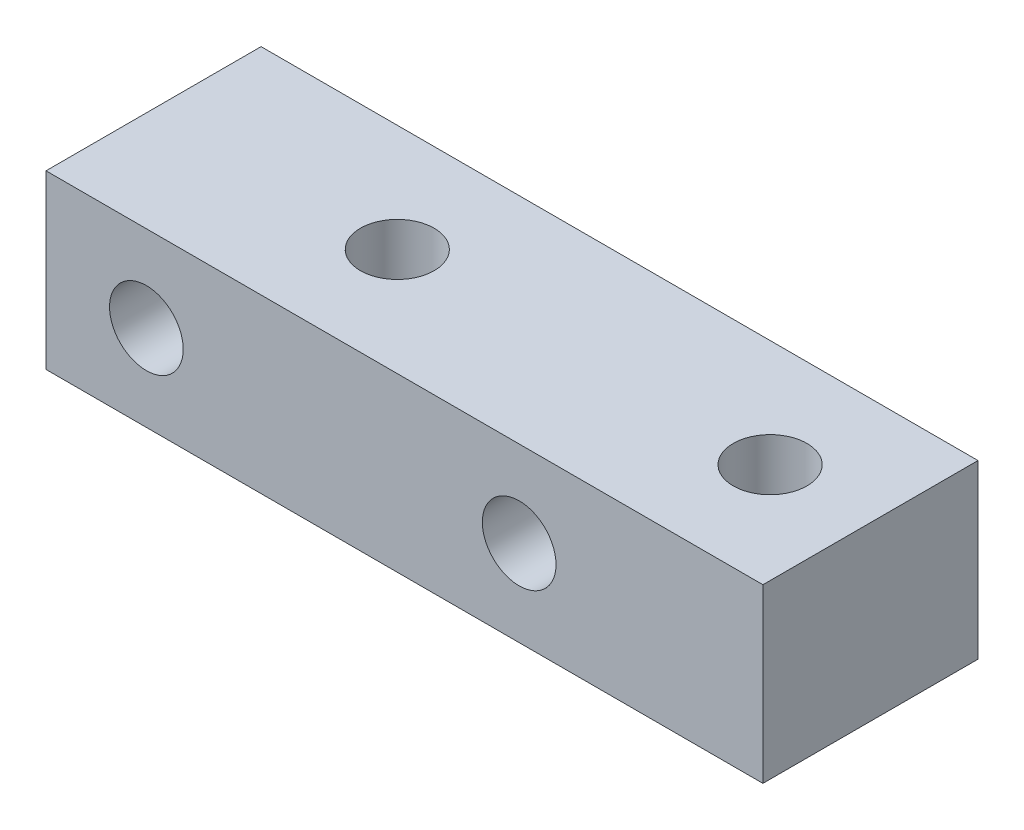
ISO-10303-21;
HEADER;
FILE_DESCRIPTION(('STEP AP214'),'2;1');
FILE_NAME('part.step','',(''),(''),'','','');
FILE_SCHEMA(('AUTOMOTIVE_DESIGN { 1 0 10303 214 1 1 1 1 }'));
ENDSEC;
DATA;
#1=APPLICATION_CONTEXT('core data for automotive mechanical design processes');
#2=APPLICATION_PROTOCOL_DEFINITION('international standard','automotive_design',2000,#1);
#3=PRODUCT_CONTEXT('',#1,'mechanical');
#4=PRODUCT('Part','Part','',(#3));
#5=PRODUCT_RELATED_PRODUCT_CATEGORY('part','',(#4));
#6=PRODUCT_DEFINITION_FORMATION('','',#4);
#7=PRODUCT_DEFINITION_CONTEXT('part definition',#1,'design');
#8=PRODUCT_DEFINITION('design','',#6,#7);
#9=PRODUCT_DEFINITION_SHAPE('','',#8);
#10=(LENGTH_UNIT() NAMED_UNIT(*) SI_UNIT(.MILLI.,.METRE.));
#11=(NAMED_UNIT(*) PLANE_ANGLE_UNIT() SI_UNIT($,.RADIAN.));
#12=(NAMED_UNIT(*) SI_UNIT($,.STERADIAN.) SOLID_ANGLE_UNIT());
#13=UNCERTAINTY_MEASURE_WITH_UNIT(LENGTH_MEASURE(1.E-05),#10,'distance_accuracy_value','');
#14=(GEOMETRIC_REPRESENTATION_CONTEXT(3) GLOBAL_UNCERTAINTY_ASSIGNED_CONTEXT((#13)) GLOBAL_UNIT_ASSIGNED_CONTEXT((#10,
#11,#12)) REPRESENTATION_CONTEXT('',''));
#15=CARTESIAN_POINT('',(0.,0.,0.));
#16=DIRECTION('',(0.,0.,1.));
#17=DIRECTION('',(1.,0.,0.));
#18=AXIS2_PLACEMENT_3D('',#15,#16,#17);
#19=CARTESIAN_POINT('',(31.75,-15.24,-9.525));
#20=DIRECTION('',(1.,0.,0.));
#21=DIRECTION('',(0.,0.,-1.));
#22=AXIS2_PLACEMENT_3D('',#19,#20,#21);
#23=PLANE('',#22);
#24=DIRECTION('',(0.,0.,-1.));
#25=VECTOR('',#24,1.);
#26=CARTESIAN_POINT('',(31.75,0.,-9.525));
#27=LINE('',#26,#25);
#28=CARTESIAN_POINT('',(31.75,0.,9.525));
#29=VERTEX_POINT('',#28);
#30=CARTESIAN_POINT('',(31.75,0.,-9.525));
#31=VERTEX_POINT('',#30);
#32=EDGE_CURVE('E103',#29,#31,#27,.T.);
#33=ORIENTED_EDGE('',*,*,#32,.F.);
#34=DIRECTION('',(0.,1.,0.));
#35=VECTOR('',#34,1.);
#36=CARTESIAN_POINT('',(31.75,-15.24,9.525));
#37=LINE('',#36,#35);
#38=CARTESIAN_POINT('',(31.75,-15.24,9.525));
#39=VERTEX_POINT('',#38);
#40=EDGE_CURVE('E11',#39,#29,#37,.T.);
#41=ORIENTED_EDGE('',*,*,#40,.F.);
#42=DIRECTION('',(0.,0.,-1.));
#43=VECTOR('',#42,1.);
#44=CARTESIAN_POINT('',(31.75,-15.24,-9.525));
#45=LINE('',#44,#43);
#46=CARTESIAN_POINT('',(31.75,-15.24,-9.525));
#47=VERTEX_POINT('',#46);
#48=EDGE_CURVE('E96',#39,#47,#45,.T.);
#49=ORIENTED_EDGE('',*,*,#48,.T.);
#50=DIRECTION('',(0.,1.,0.));
#51=VECTOR('',#50,1.);
#52=CARTESIAN_POINT('',(31.75,-15.24,-9.525));
#53=LINE('',#52,#51);
#54=EDGE_CURVE('E41',#47,#31,#53,.T.);
#55=ORIENTED_EDGE('',*,*,#54,.T.);
#56=EDGE_LOOP('',(#33,#41,#49,#55));
#57=FACE_BOUND('',#56,.T.);
#58=ADVANCED_FACE('F38',(#57),#23,.T.);
#59=CARTESIAN_POINT('',(-31.75,-15.24,9.525));
#60=DIRECTION('',(0.,0.,1.));
#61=DIRECTION('',(1.,0.,0.));
#62=AXIS2_PLACEMENT_3D('',#59,#60,#61);
#63=PLANE('',#62);
#64=CARTESIAN_POINT('',(-22.86,-7.62,9.525));
#65=DIRECTION('',(0.,0.,1.));
#66=DIRECTION('',(1.,0.,0.));
#67=AXIS2_PLACEMENT_3D('',#64,#65,#66);
#68=CIRCLE('',#67,3.26389999999999);
#69=CARTESIAN_POINT('',(-19.5961,-7.62,9.525));
#70=VERTEX_POINT('',#69);
#71=EDGE_CURVE('E147',#70,#70,#68,.T.);
#72=ORIENTED_EDGE('',*,*,#71,.F.);
#73=EDGE_LOOP('',(#72));
#74=FACE_BOUND('',#73,.T.);
#75=CARTESIAN_POINT('',(10.16,-7.62,9.525));
#76=DIRECTION('',(0.,0.,1.));
#77=DIRECTION('',(1.,0.,0.));
#78=AXIS2_PLACEMENT_3D('',#75,#76,#77);
#79=CIRCLE('',#78,3.26389999999999);
#80=CARTESIAN_POINT('',(13.4239,-7.62,9.525));
#81=VERTEX_POINT('',#80);
#82=EDGE_CURVE('E142',#81,#81,#79,.T.);
#83=ORIENTED_EDGE('',*,*,#82,.F.);
#84=EDGE_LOOP('',(#83));
#85=FACE_BOUND('',#84,.T.);
#86=DIRECTION('',(1.,0.,0.));
#87=VECTOR('',#86,1.);
#88=CARTESIAN_POINT('',(-31.75,0.,9.525));
#89=LINE('',#88,#87);
#90=CARTESIAN_POINT('',(-31.75,0.,9.525));
#91=VERTEX_POINT('',#90);
#92=EDGE_CURVE('E98',#91,#29,#89,.T.);
#93=ORIENTED_EDGE('',*,*,#92,.F.);
#94=DIRECTION('',(0.,1.,0.));
#95=VECTOR('',#94,1.);
#96=CARTESIAN_POINT('',(-31.75,-15.24,9.525));
#97=LINE('',#96,#95);
#98=CARTESIAN_POINT('',(-31.75,-15.24,9.525));
#99=VERTEX_POINT('',#98);
#100=EDGE_CURVE('E47',#99,#91,#97,.T.);
#101=ORIENTED_EDGE('',*,*,#100,.F.);
#102=DIRECTION('',(1.,0.,0.));
#103=VECTOR('',#102,1.);
#104=CARTESIAN_POINT('',(-31.75,-15.24,9.525));
#105=LINE('',#104,#103);
#106=EDGE_CURVE('E93',#99,#39,#105,.T.);
#107=ORIENTED_EDGE('',*,*,#106,.T.);
#108=ORIENTED_EDGE('',*,*,#40,.T.);
#109=EDGE_LOOP('',(#93,#101,#107,#108));
#110=FACE_BOUND('',#109,.T.);
#111=ADVANCED_FACE('F114',(#74,#85,#110),#63,.T.);
#112=CARTESIAN_POINT('',(-31.75,-15.24,-9.525));
#113=DIRECTION('',(-1.,0.,0.));
#114=DIRECTION('',(0.,0.,1.));
#115=AXIS2_PLACEMENT_3D('',#112,#113,#114);
#116=PLANE('',#115);
#117=DIRECTION('',(0.,0.,1.));
#118=VECTOR('',#117,1.);
#119=CARTESIAN_POINT('',(-31.75,0.,-9.525));
#120=LINE('',#119,#118);
#121=CARTESIAN_POINT('',(-31.75,0.,-9.525));
#122=VERTEX_POINT('',#121);
#123=EDGE_CURVE('E88',#122,#91,#120,.T.);
#124=ORIENTED_EDGE('',*,*,#123,.F.);
#125=DIRECTION('',(0.,1.,0.));
#126=VECTOR('',#125,1.);
#127=CARTESIAN_POINT('',(-31.75,-15.24,-9.525));
#128=LINE('',#127,#126);
#129=CARTESIAN_POINT('',(-31.75,-15.24,-9.525));
#130=VERTEX_POINT('',#129);
#131=EDGE_CURVE('E83',#130,#122,#128,.T.);
#132=ORIENTED_EDGE('',*,*,#131,.F.);
#133=DIRECTION('',(0.,0.,1.));
#134=VECTOR('',#133,1.);
#135=CARTESIAN_POINT('',(-31.75,-15.24,-9.525));
#136=LINE('',#135,#134);
#137=EDGE_CURVE('E86',#130,#99,#136,.T.);
#138=ORIENTED_EDGE('',*,*,#137,.T.);
#139=ORIENTED_EDGE('',*,*,#100,.T.);
#140=EDGE_LOOP('',(#124,#132,#138,#139));
#141=FACE_BOUND('',#140,.T.);
#142=ADVANCED_FACE('F85',(#141),#116,.T.);
#143=CARTESIAN_POINT('',(-31.75,-15.24,-9.525));
#144=DIRECTION('',(0.,0.,-1.));
#145=DIRECTION('',(-1.,0.,0.));
#146=AXIS2_PLACEMENT_3D('',#143,#144,#145);
#147=PLANE('',#146);
#148=CARTESIAN_POINT('',(-22.86,-7.62,-9.525));
#149=DIRECTION('',(0.,0.,1.));
#150=DIRECTION('',(1.,0.,0.));
#151=AXIS2_PLACEMENT_3D('',#148,#149,#150);
#152=CIRCLE('',#151,3.2639);
#153=CARTESIAN_POINT('',(-19.5961,-7.62,-9.525));
#154=VERTEX_POINT('',#153);
#155=EDGE_CURVE('E138',#154,#154,#152,.T.);
#156=ORIENTED_EDGE('',*,*,#155,.T.);
#157=EDGE_LOOP('',(#156));
#158=FACE_BOUND('',#157,.T.);
#159=CARTESIAN_POINT('',(10.16,-7.62,-9.525));
#160=DIRECTION('',(0.,0.,1.));
#161=DIRECTION('',(1.,0.,0.));
#162=AXIS2_PLACEMENT_3D('',#159,#160,#161);
#163=CIRCLE('',#162,3.2639);
#164=CARTESIAN_POINT('',(13.4239,-7.62,-9.525));
#165=VERTEX_POINT('',#164);
#166=EDGE_CURVE('E107',#165,#165,#163,.T.);
#167=ORIENTED_EDGE('',*,*,#166,.T.);
#168=EDGE_LOOP('',(#167));
#169=FACE_BOUND('',#168,.T.);
#170=DIRECTION('',(-1.,0.,0.));
#171=VECTOR('',#170,1.);
#172=CARTESIAN_POINT('',(-31.75,0.,-9.525));
#173=LINE('',#172,#171);
#174=EDGE_CURVE('E106',#31,#122,#173,.T.);
#175=ORIENTED_EDGE('',*,*,#174,.F.);
#176=ORIENTED_EDGE('',*,*,#54,.F.);
#177=DIRECTION('',(-1.,0.,0.));
#178=VECTOR('',#177,1.);
#179=CARTESIAN_POINT('',(-31.75,-15.24,-9.525));
#180=LINE('',#179,#178);
#181=EDGE_CURVE('E92',#47,#130,#180,.T.);
#182=ORIENTED_EDGE('',*,*,#181,.T.);
#183=ORIENTED_EDGE('',*,*,#131,.T.);
#184=EDGE_LOOP('',(#175,#176,#182,#183));
#185=FACE_BOUND('',#184,.T.);
#186=ADVANCED_FACE('F95',(#158,#169,#185),#147,.T.);
#187=CARTESIAN_POINT('',(0.,-15.24,0.));
#188=DIRECTION('',(0.,1.,0.));
#189=DIRECTION('',(0.,0.,1.));
#190=AXIS2_PLACEMENT_3D('',#187,#188,#189);
#191=PLANE('',#190);
#192=CARTESIAN_POINT('',(-10.16,-15.24,0.));
#193=DIRECTION('',(0.,1.,0.));
#194=DIRECTION('',(0.,0.,1.));
#195=AXIS2_PLACEMENT_3D('',#192,#193,#194);
#196=CIRCLE('',#195,3.2639);
#197=CARTESIAN_POINT('',(-10.16,-15.24,3.2639));
#198=VERTEX_POINT('',#197);
#199=EDGE_CURVE('E156',#198,#198,#196,.T.);
#200=ORIENTED_EDGE('',*,*,#199,.T.);
#201=EDGE_LOOP('',(#200));
#202=FACE_BOUND('',#201,.T.);
#203=CARTESIAN_POINT('',(22.86,-15.24,0.));
#204=DIRECTION('',(0.,1.,0.));
#205=DIRECTION('',(0.,0.,1.));
#206=AXIS2_PLACEMENT_3D('',#203,#204,#205);
#207=CIRCLE('',#206,3.2639);
#208=CARTESIAN_POINT('',(22.86,-15.24,3.2639));
#209=VERTEX_POINT('',#208);
#210=EDGE_CURVE('E150',#209,#209,#207,.T.);
#211=ORIENTED_EDGE('',*,*,#210,.T.);
#212=EDGE_LOOP('',(#211));
#213=FACE_BOUND('',#212,.T.);
#214=ORIENTED_EDGE('',*,*,#48,.F.);
#215=ORIENTED_EDGE('',*,*,#106,.F.);
#216=ORIENTED_EDGE('',*,*,#137,.F.);
#217=ORIENTED_EDGE('',*,*,#181,.F.);
#218=EDGE_LOOP('',(#214,#215,#216,#217));
#219=FACE_BOUND('',#218,.T.);
#220=ADVANCED_FACE('F91',(#202,#213,#219),#191,.F.);
#221=CARTESIAN_POINT('',(0.,0.,0.));
#222=DIRECTION('',(0.,1.,0.));
#223=DIRECTION('',(0.,0.,1.));
#224=AXIS2_PLACEMENT_3D('',#221,#222,#223);
#225=PLANE('',#224);
#226=CARTESIAN_POINT('',(-10.16,0.,0.));
#227=DIRECTION('',(0.,1.,0.));
#228=DIRECTION('',(0.,0.,1.));
#229=AXIS2_PLACEMENT_3D('',#226,#227,#228);
#230=CIRCLE('',#229,3.26389999999999);
#231=CARTESIAN_POINT('',(-10.16,0.,3.26389999999999));
#232=VERTEX_POINT('',#231);
#233=EDGE_CURVE('E159',#232,#232,#230,.T.);
#234=ORIENTED_EDGE('',*,*,#233,.F.);
#235=EDGE_LOOP('',(#234));
#236=FACE_BOUND('',#235,.T.);
#237=CARTESIAN_POINT('',(22.86,0.,0.));
#238=DIRECTION('',(0.,1.,0.));
#239=DIRECTION('',(0.,0.,1.));
#240=AXIS2_PLACEMENT_3D('',#237,#238,#239);
#241=CIRCLE('',#240,3.26389999999999);
#242=CARTESIAN_POINT('',(22.86,0.,3.26389999999999));
#243=VERTEX_POINT('',#242);
#244=EDGE_CURVE('E153',#243,#243,#241,.T.);
#245=ORIENTED_EDGE('',*,*,#244,.F.);
#246=EDGE_LOOP('',(#245));
#247=FACE_BOUND('',#246,.T.);
#248=ORIENTED_EDGE('',*,*,#32,.T.);
#249=ORIENTED_EDGE('',*,*,#174,.T.);
#250=ORIENTED_EDGE('',*,*,#123,.T.);
#251=ORIENTED_EDGE('',*,*,#92,.T.);
#252=EDGE_LOOP('',(#248,#249,#250,#251));
#253=FACE_BOUND('',#252,.T.);
#254=ADVANCED_FACE('F113',(#236,#247,#253),#225,.T.);
#255=CARTESIAN_POINT('',(10.16,-7.62,9.525));
#256=DIRECTION('',(0.,0.,1.));
#257=DIRECTION('',(1.,0.,0.));
#258=AXIS2_PLACEMENT_3D('',#255,#256,#257);
#259=CYLINDRICAL_SURFACE('',#258,3.26389999999999);
#260=ORIENTED_EDGE('',*,*,#166,.F.);
#261=EDGE_LOOP('',(#260));
#262=FACE_BOUND('',#261,.T.);
#263=ORIENTED_EDGE('',*,*,#82,.T.);
#264=EDGE_LOOP('',(#263));
#265=FACE_BOUND('',#264,.T.);
#266=ADVANCED_FACE('F167',(#262,#265),#259,.F.);
#267=CARTESIAN_POINT('',(-22.86,-7.62,9.525));
#268=DIRECTION('',(0.,0.,1.));
#269=DIRECTION('',(1.,0.,0.));
#270=AXIS2_PLACEMENT_3D('',#267,#268,#269);
#271=CYLINDRICAL_SURFACE('',#270,3.26389999999999);
#272=ORIENTED_EDGE('',*,*,#155,.F.);
#273=EDGE_LOOP('',(#272));
#274=FACE_BOUND('',#273,.T.);
#275=ORIENTED_EDGE('',*,*,#71,.T.);
#276=EDGE_LOOP('',(#275));
#277=FACE_BOUND('',#276,.T.);
#278=ADVANCED_FACE('F172',(#274,#277),#271,.F.);
#279=CARTESIAN_POINT('',(22.86,0.,0.));
#280=DIRECTION('',(0.,1.,0.));
#281=DIRECTION('',(0.,0.,1.));
#282=AXIS2_PLACEMENT_3D('',#279,#280,#281);
#283=CYLINDRICAL_SURFACE('',#282,3.26389999999999);
#284=ORIENTED_EDGE('',*,*,#210,.F.);
#285=EDGE_LOOP('',(#284));
#286=FACE_BOUND('',#285,.T.);
#287=ORIENTED_EDGE('',*,*,#244,.T.);
#288=EDGE_LOOP('',(#287));
#289=FACE_BOUND('',#288,.T.);
#290=ADVANCED_FACE('F170',(#286,#289),#283,.F.);
#291=CARTESIAN_POINT('',(-10.16,0.,0.));
#292=DIRECTION('',(0.,1.,0.));
#293=DIRECTION('',(0.,0.,1.));
#294=AXIS2_PLACEMENT_3D('',#291,#292,#293);
#295=CYLINDRICAL_SURFACE('',#294,3.26389999999999);
#296=ORIENTED_EDGE('',*,*,#199,.F.);
#297=EDGE_LOOP('',(#296));
#298=FACE_BOUND('',#297,.T.);
#299=ORIENTED_EDGE('',*,*,#233,.T.);
#300=EDGE_LOOP('',(#299));
#301=FACE_BOUND('',#300,.T.);
#302=ADVANCED_FACE('F163',(#298,#301),#295,.F.);
#303=CLOSED_SHELL('',(#58,#111,#142,#186,#220,#254,#266,#278,#290,#302));
#304=MANIFOLD_SOLID_BREP('B2',#303);
#305=ADVANCED_BREP_SHAPE_REPRESENTATION('',(#18,#304),#14);
#306=SHAPE_DEFINITION_REPRESENTATION(#9,#305);
ENDSEC;
END-ISO-10303-21;
